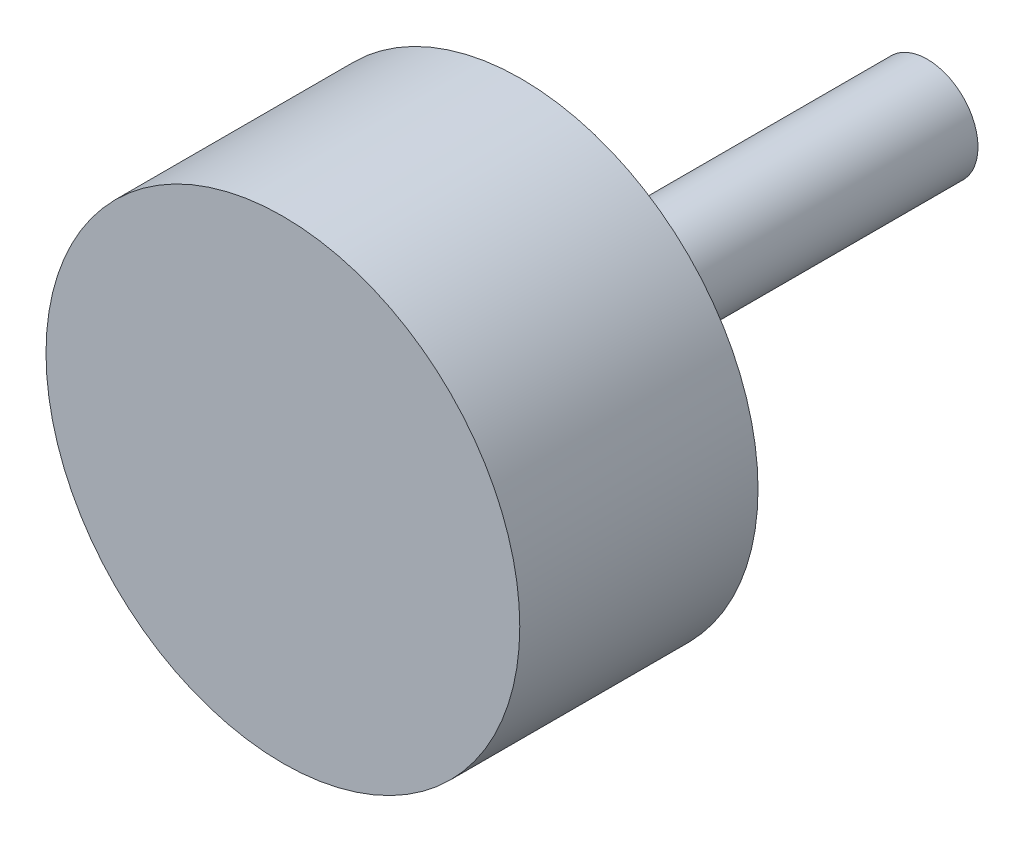
ISO-10303-21;
HEADER;
FILE_DESCRIPTION(('STEP AP214'),'2;1');
FILE_NAME('part.step','',(''),(''),'','','');
FILE_SCHEMA(('AUTOMOTIVE_DESIGN { 1 0 10303 214 1 1 1 1 }'));
ENDSEC;
DATA;
#1=APPLICATION_CONTEXT('core data for automotive mechanical design processes');
#2=APPLICATION_PROTOCOL_DEFINITION('international standard','automotive_design',2000,#1);
#3=PRODUCT_CONTEXT('',#1,'mechanical');
#4=PRODUCT('Part','Part','',(#3));
#5=PRODUCT_RELATED_PRODUCT_CATEGORY('part','',(#4));
#6=PRODUCT_DEFINITION_FORMATION('','',#4);
#7=PRODUCT_DEFINITION_CONTEXT('part definition',#1,'design');
#8=PRODUCT_DEFINITION('design','',#6,#7);
#9=PRODUCT_DEFINITION_SHAPE('','',#8);
#10=(LENGTH_UNIT() NAMED_UNIT(*) SI_UNIT(.MILLI.,.METRE.));
#11=(NAMED_UNIT(*) PLANE_ANGLE_UNIT() SI_UNIT($,.RADIAN.));
#12=(NAMED_UNIT(*) SI_UNIT($,.STERADIAN.) SOLID_ANGLE_UNIT());
#13=UNCERTAINTY_MEASURE_WITH_UNIT(LENGTH_MEASURE(1.E-05),#10,'distance_accuracy_value','');
#14=(GEOMETRIC_REPRESENTATION_CONTEXT(3) GLOBAL_UNCERTAINTY_ASSIGNED_CONTEXT((#13)) GLOBAL_UNIT_ASSIGNED_CONTEXT((#10,
#11,#12)) REPRESENTATION_CONTEXT('',''));
#15=CARTESIAN_POINT('',(0.,0.,0.));
#16=DIRECTION('',(0.,0.,1.));
#17=DIRECTION('',(1.,0.,0.));
#18=AXIS2_PLACEMENT_3D('',#15,#16,#17);
#19=CARTESIAN_POINT('',(0.,0.,22.352));
#20=DIRECTION('',(0.,0.,-1.));
#21=DIRECTION('',(-1.,0.,0.));
#22=AXIS2_PLACEMENT_3D('',#19,#20,#21);
#23=CYLINDRICAL_SURFACE('',#22,22.225);
#24=CARTESIAN_POINT('',(0.,0.,22.352));
#25=DIRECTION('',(0.,0.,1.));
#26=DIRECTION('',(1.,0.,0.));
#27=AXIS2_PLACEMENT_3D('',#24,#25,#26);
#28=CIRCLE('',#27,22.225);
#29=CARTESIAN_POINT('',(22.225,0.,22.352));
#30=VERTEX_POINT('',#29);
#31=EDGE_CURVE('E10',#30,#30,#28,.T.);
#32=ORIENTED_EDGE('',*,*,#31,.F.);
#33=EDGE_LOOP('',(#32));
#34=FACE_BOUND('',#33,.T.);
#35=CARTESIAN_POINT('',(0.,0.,0.));
#36=DIRECTION('',(0.,0.,1.));
#37=DIRECTION('',(1.,0.,0.));
#38=AXIS2_PLACEMENT_3D('',#35,#36,#37);
#39=CIRCLE('',#38,22.225);
#40=CARTESIAN_POINT('',(22.225,0.,0.));
#41=VERTEX_POINT('',#40);
#42=EDGE_CURVE('E34',#41,#41,#39,.T.);
#43=ORIENTED_EDGE('',*,*,#42,.T.);
#44=EDGE_LOOP('',(#43));
#45=FACE_BOUND('',#44,.T.);
#46=ADVANCED_FACE('F31',(#34,#45),#23,.T.);
#47=CARTESIAN_POINT('',(0.,0.,22.352));
#48=DIRECTION('',(0.,0.,1.));
#49=DIRECTION('',(1.,0.,0.));
#50=AXIS2_PLACEMENT_3D('',#47,#48,#49);
#51=PLANE('',#50);
#52=ORIENTED_EDGE('',*,*,#31,.T.);
#53=EDGE_LOOP('',(#52));
#54=FACE_BOUND('',#53,.T.);
#55=ADVANCED_FACE('F61',(#54),#51,.T.);
#56=CARTESIAN_POINT('',(0.,0.,0.));
#57=DIRECTION('',(0.,0.,1.));
#58=DIRECTION('',(1.,0.,0.));
#59=AXIS2_PLACEMENT_3D('',#56,#57,#58);
#60=PLANE('',#59);
#61=CARTESIAN_POINT('',(0.,0.,0.));
#62=DIRECTION('',(0.,0.,1.));
#63=DIRECTION('',(1.,0.,0.));
#64=AXIS2_PLACEMENT_3D('',#61,#62,#63);
#65=CIRCLE('',#64,4.7625);
#66=CARTESIAN_POINT('',(4.7625,0.,0.));
#67=VERTEX_POINT('',#66);
#68=EDGE_CURVE('E43',#67,#67,#65,.T.);
#69=ORIENTED_EDGE('',*,*,#68,.T.);
#70=EDGE_LOOP('',(#69));
#71=FACE_BOUND('',#70,.T.);
#72=ORIENTED_EDGE('',*,*,#42,.F.);
#73=EDGE_LOOP('',(#72));
#74=FACE_BOUND('',#73,.T.);
#75=ADVANCED_FACE('F58',(#71,#74),#60,.F.);
#76=CARTESIAN_POINT('',(0.,0.,-38.1));
#77=DIRECTION('',(0.,0.,1.));
#78=DIRECTION('',(1.,0.,0.));
#79=AXIS2_PLACEMENT_3D('',#76,#77,#78);
#80=CYLINDRICAL_SURFACE('',#79,4.7625);
#81=CARTESIAN_POINT('',(0.,0.,-38.1));
#82=DIRECTION('',(0.,0.,1.));
#83=DIRECTION('',(1.,0.,0.));
#84=AXIS2_PLACEMENT_3D('',#81,#82,#83);
#85=CIRCLE('',#84,4.7625);
#86=CARTESIAN_POINT('',(4.7625,0.,-38.1));
#87=VERTEX_POINT('',#86);
#88=EDGE_CURVE('E41',#87,#87,#85,.T.);
#89=ORIENTED_EDGE('',*,*,#88,.T.);
#90=EDGE_LOOP('',(#89));
#91=FACE_BOUND('',#90,.T.);
#92=ORIENTED_EDGE('',*,*,#68,.F.);
#93=EDGE_LOOP('',(#92));
#94=FACE_BOUND('',#93,.T.);
#95=ADVANCED_FACE('F49',(#91,#94),#80,.T.);
#96=CARTESIAN_POINT('',(0.,0.,-38.1));
#97=DIRECTION('',(0.,0.,1.));
#98=DIRECTION('',(1.,0.,0.));
#99=AXIS2_PLACEMENT_3D('',#96,#97,#98);
#100=PLANE('',#99);
#101=ORIENTED_EDGE('',*,*,#88,.F.);
#102=EDGE_LOOP('',(#101));
#103=FACE_BOUND('',#102,.T.);
#104=ADVANCED_FACE('F52',(#103),#100,.F.);
#105=CLOSED_SHELL('',(#46,#55,#75,#95,#104));
#106=MANIFOLD_SOLID_BREP('B2',#105);
#107=ADVANCED_BREP_SHAPE_REPRESENTATION('',(#18,#106),#14);
#108=SHAPE_DEFINITION_REPRESENTATION(#9,#107);
ENDSEC;
END-ISO-10303-21;
